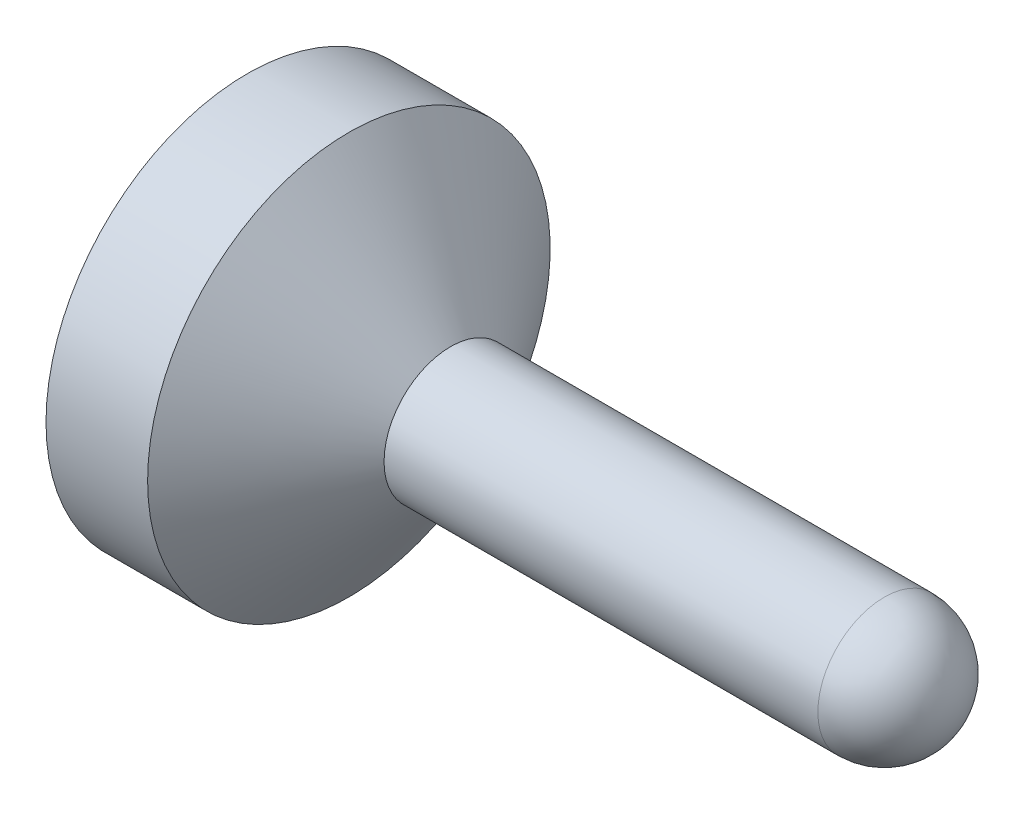
ISO-10303-21;
HEADER;
FILE_DESCRIPTION(('STEP AP214'),'2;1');
FILE_NAME('part.step','',(''),(''),'','','');
FILE_SCHEMA(('AUTOMOTIVE_DESIGN { 1 0 10303 214 1 1 1 1 }'));
ENDSEC;
DATA;
#1=APPLICATION_CONTEXT('core data for automotive mechanical design processes');
#2=APPLICATION_PROTOCOL_DEFINITION('international standard','automotive_design',2000,#1);
#3=PRODUCT_CONTEXT('',#1,'mechanical');
#4=PRODUCT('Part','Part','',(#3));
#5=PRODUCT_RELATED_PRODUCT_CATEGORY('part','',(#4));
#6=PRODUCT_DEFINITION_FORMATION('','',#4);
#7=PRODUCT_DEFINITION_CONTEXT('part definition',#1,'design');
#8=PRODUCT_DEFINITION('design','',#6,#7);
#9=PRODUCT_DEFINITION_SHAPE('','',#8);
#10=(LENGTH_UNIT() NAMED_UNIT(*) SI_UNIT(.MILLI.,.METRE.));
#11=(NAMED_UNIT(*) PLANE_ANGLE_UNIT() SI_UNIT($,.RADIAN.));
#12=(NAMED_UNIT(*) SI_UNIT($,.STERADIAN.) SOLID_ANGLE_UNIT());
#13=UNCERTAINTY_MEASURE_WITH_UNIT(LENGTH_MEASURE(1.E-05),#10,'distance_accuracy_value','');
#14=(GEOMETRIC_REPRESENTATION_CONTEXT(3) GLOBAL_UNCERTAINTY_ASSIGNED_CONTEXT((#13)) GLOBAL_UNIT_ASSIGNED_CONTEXT((#10,
#11,#12)) REPRESENTATION_CONTEXT('',''));
#15=CARTESIAN_POINT('',(0.,0.,0.));
#16=DIRECTION('',(0.,0.,1.));
#17=DIRECTION('',(1.,0.,0.));
#18=AXIS2_PLACEMENT_3D('',#15,#16,#17);
#19=CARTESIAN_POINT('',(2.07010000000005,0.,0.));
#20=DIRECTION('',(-1.,0.,0.));
#21=DIRECTION('',(0.,1.,0.));
#22=AXIS2_PLACEMENT_3D('',#19,#20,#21);
#23=SPHERICAL_SURFACE('',#22,0.215899999999991);
#24=CARTESIAN_POINT('',(2.07010000000005,0.,0.));
#25=DIRECTION('',(-1.,0.,0.));
#26=DIRECTION('',(0.,0.,1.));
#27=AXIS2_PLACEMENT_3D('',#24,#25,#26);
#28=CIRCLE('',#27,0.215899999999988);
#29=CARTESIAN_POINT('',(2.07010000000005,0.,0.215899999999988));
#30=VERTEX_POINT('',#29);
#31=EDGE_CURVE('E10',#30,#30,#28,.T.);
#32=ORIENTED_EDGE('',*,*,#31,.F.);
#33=EDGE_LOOP('',(#32));
#34=FACE_BOUND('',#33,.T.);
#35=ADVANCED_FACE('F31',(#34),#23,.T.);
#36=CARTESIAN_POINT('',(0.,0.,0.));
#37=DIRECTION('',(-1.,0.,0.));
#38=DIRECTION('',(0.,0.,1.));
#39=AXIS2_PLACEMENT_3D('',#36,#37,#38);
#40=CYLINDRICAL_SURFACE('',#39,0.215899999999988);
#41=CARTESIAN_POINT('',(0.660369707052573,0.,0.));
#42=DIRECTION('',(-1.,0.,0.));
#43=DIRECTION('',(0.,0.,1.));
#44=AXIS2_PLACEMENT_3D('',#41,#42,#43);
#45=CIRCLE('',#44,0.215899999999988);
#46=CARTESIAN_POINT('',(0.660369707052573,0.,0.215899999999988));
#47=VERTEX_POINT('',#46);
#48=EDGE_CURVE('E37',#47,#47,#45,.T.);
#49=ORIENTED_EDGE('',*,*,#48,.F.);
#50=EDGE_LOOP('',(#49));
#51=FACE_BOUND('',#50,.T.);
#52=ORIENTED_EDGE('',*,*,#31,.T.);
#53=EDGE_LOOP('',(#52));
#54=FACE_BOUND('',#53,.T.);
#55=ADVANCED_FACE('F61',(#51,#54),#40,.T.);
#56=CARTESIAN_POINT('',(0.660369707052573,0.,0.));
#57=DIRECTION('',(-1.,0.,0.));
#58=DIRECTION('',(0.,0.,1.));
#59=AXIS2_PLACEMENT_3D('',#56,#57,#58);
#60=CONICAL_SURFACE('',#59,0.215899999999988,0.925024503556982);
#61=CARTESIAN_POINT('',(0.330200000000003,0.,0.));
#62=DIRECTION('',(-1.,0.,0.));
#63=DIRECTION('',(0.,0.,1.));
#64=AXIS2_PLACEMENT_3D('',#61,#62,#63);
#65=CIRCLE('',#64,0.654050000000017);
#66=CARTESIAN_POINT('',(0.330200000000003,0.,0.654050000000017));
#67=VERTEX_POINT('',#66);
#68=EDGE_CURVE('E41',#67,#67,#65,.T.);
#69=ORIENTED_EDGE('',*,*,#68,.F.);
#70=EDGE_LOOP('',(#69));
#71=FACE_BOUND('',#70,.T.);
#72=ORIENTED_EDGE('',*,*,#48,.T.);
#73=EDGE_LOOP('',(#72));
#74=FACE_BOUND('',#73,.T.);
#75=ADVANCED_FACE('F56',(#71,#74),#60,.T.);
#76=CARTESIAN_POINT('',(0.,0.,0.));
#77=DIRECTION('',(-1.,0.,0.));
#78=DIRECTION('',(0.,0.,1.));
#79=AXIS2_PLACEMENT_3D('',#76,#77,#78);
#80=CYLINDRICAL_SURFACE('',#79,0.654050000000017);
#81=CARTESIAN_POINT('',(0.,0.,0.));
#82=DIRECTION('',(-1.,0.,0.));
#83=DIRECTION('',(0.,0.,1.));
#84=AXIS2_PLACEMENT_3D('',#81,#82,#83);
#85=CIRCLE('',#84,0.654050000000017);
#86=CARTESIAN_POINT('',(0.,0.,0.654050000000017));
#87=VERTEX_POINT('',#86);
#88=EDGE_CURVE('E45',#87,#87,#85,.T.);
#89=ORIENTED_EDGE('',*,*,#88,.F.);
#90=EDGE_LOOP('',(#89));
#91=FACE_BOUND('',#90,.T.);
#92=ORIENTED_EDGE('',*,*,#68,.T.);
#93=EDGE_LOOP('',(#92));
#94=FACE_BOUND('',#93,.T.);
#95=ADVANCED_FACE('F53',(#91,#94),#80,.T.);
#96=CARTESIAN_POINT('',(0.,0.,0.));
#97=DIRECTION('',(1.,0.,0.));
#98=DIRECTION('',(0.,0.,-1.));
#99=AXIS2_PLACEMENT_3D('',#96,#97,#98);
#100=PLANE('',#99);
#101=ORIENTED_EDGE('',*,*,#88,.T.);
#102=EDGE_LOOP('',(#101));
#103=FACE_BOUND('',#102,.T.);
#104=ADVANCED_FACE('F51',(#103),#100,.F.);
#105=CLOSED_SHELL('',(#35,#55,#75,#95,#104));
#106=MANIFOLD_SOLID_BREP('B2',#105);
#107=ADVANCED_BREP_SHAPE_REPRESENTATION('',(#18,#106),#14);
#108=SHAPE_DEFINITION_REPRESENTATION(#9,#107);
ENDSEC;
END-ISO-10303-21;
